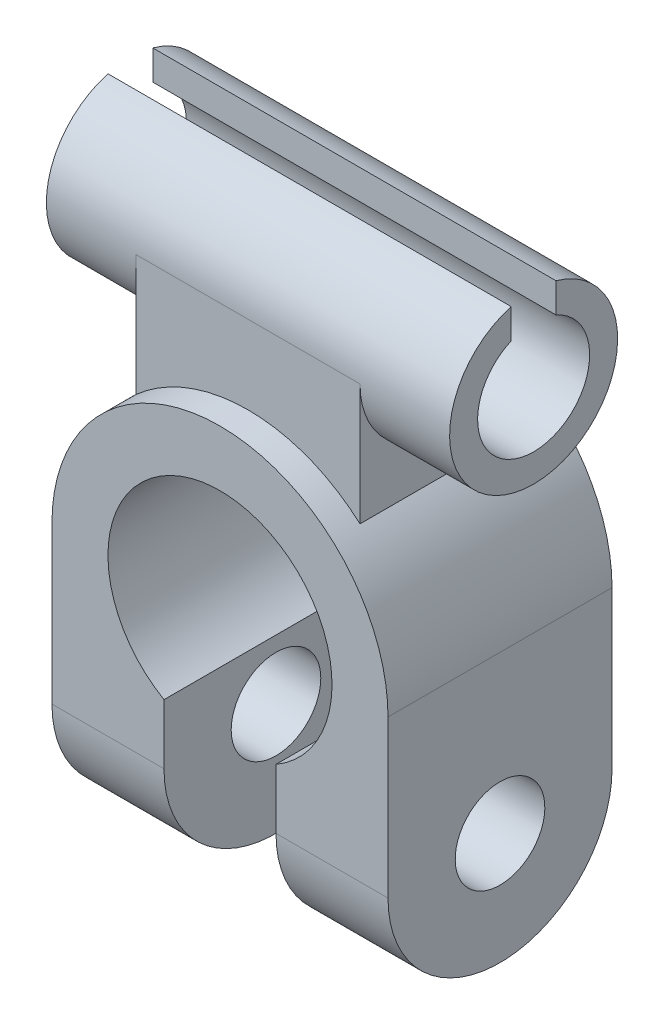
ISO-10303-21;
HEADER;
FILE_DESCRIPTION(('STEP AP214'),'2;1');
FILE_NAME('part.step','',(''),(''),'','','');
FILE_SCHEMA(('AUTOMOTIVE_DESIGN { 1 0 10303 214 1 1 1 1 }'));
ENDSEC;
DATA;
#1=APPLICATION_CONTEXT('core data for automotive mechanical design processes');
#2=APPLICATION_PROTOCOL_DEFINITION('international standard','automotive_design',2000,#1);
#3=PRODUCT_CONTEXT('',#1,'mechanical');
#4=PRODUCT('Part','Part','',(#3));
#5=PRODUCT_RELATED_PRODUCT_CATEGORY('part','',(#4));
#6=PRODUCT_DEFINITION_FORMATION('','',#4);
#7=PRODUCT_DEFINITION_CONTEXT('part definition',#1,'design');
#8=PRODUCT_DEFINITION('design','',#6,#7);
#9=PRODUCT_DEFINITION_SHAPE('','',#8);
#10=(LENGTH_UNIT() NAMED_UNIT(*) SI_UNIT(.MILLI.,.METRE.));
#11=(NAMED_UNIT(*) PLANE_ANGLE_UNIT() SI_UNIT($,.RADIAN.));
#12=(NAMED_UNIT(*) SI_UNIT($,.STERADIAN.) SOLID_ANGLE_UNIT());
#13=UNCERTAINTY_MEASURE_WITH_UNIT(LENGTH_MEASURE(1.E-05),#10,'distance_accuracy_value','');
#14=(GEOMETRIC_REPRESENTATION_CONTEXT(3) GLOBAL_UNCERTAINTY_ASSIGNED_CONTEXT((#13)) GLOBAL_UNIT_ASSIGNED_CONTEXT((#10,
#11,#12)) REPRESENTATION_CONTEXT('',''));
#15=CARTESIAN_POINT('',(0.,0.,0.));
#16=DIRECTION('',(0.,0.,1.));
#17=DIRECTION('',(1.,0.,0.));
#18=AXIS2_PLACEMENT_3D('',#15,#16,#17);
#19=CARTESIAN_POINT('',(0.,0.,-20.));
#20=DIRECTION('',(0.,0.,1.));
#21=DIRECTION('',(1.,0.,0.));
#22=AXIS2_PLACEMENT_3D('',#19,#20,#21);
#23=CYLINDRICAL_SURFACE('',#22,15.);
#24=DIRECTION('',(0.,0.,1.));
#25=VECTOR('',#24,1.);
#26=CARTESIAN_POINT('',(10.,11.1803398874989,-20.));
#27=LINE('',#26,#25);
#28=CARTESIAN_POINT('',(10.,11.1803398874989,-2.49999999999999));
#29=VERTEX_POINT('',#28);
#30=CARTESIAN_POINT('',(10.,11.1803398874989,-17.5));
#31=VERTEX_POINT('',#30);
#32=EDGE_CURVE('E176',#29,#31,#27,.F.);
#33=ORIENTED_EDGE('',*,*,#32,.F.);
#34=CARTESIAN_POINT('',(0.,0.,-2.49999999999999));
#35=DIRECTION('',(0.,0.,-1.));
#36=DIRECTION('',(0.,1.,0.));
#37=AXIS2_PLACEMENT_3D('',#34,#35,#36);
#38=CIRCLE('',#37,15.);
#39=CARTESIAN_POINT('',(-10.,11.1803398874989,-2.49999999999999));
#40=VERTEX_POINT('',#39);
#41=EDGE_CURVE('E179',#29,#40,#38,.F.);
#42=ORIENTED_EDGE('',*,*,#41,.T.);
#43=DIRECTION('',(0.,0.,1.));
#44=VECTOR('',#43,1.);
#45=CARTESIAN_POINT('',(-10.,11.1803398874989,-20.));
#46=LINE('',#45,#44);
#47=CARTESIAN_POINT('',(-10.,11.1803398874989,-17.5));
#48=VERTEX_POINT('',#47);
#49=EDGE_CURVE('E174',#40,#48,#46,.F.);
#50=ORIENTED_EDGE('',*,*,#49,.T.);
#51=CARTESIAN_POINT('',(0.,0.,-17.5));
#52=DIRECTION('',(0.,0.,-1.));
#53=DIRECTION('',(0.,1.,0.));
#54=AXIS2_PLACEMENT_3D('',#51,#52,#53);
#55=CIRCLE('',#54,15.);
#56=EDGE_CURVE('E166',#31,#48,#55,.F.);
#57=ORIENTED_EDGE('',*,*,#56,.F.);
#58=EDGE_LOOP('',(#33,#42,#50,#57));
#59=FACE_BOUND('',#58,.T.);
#60=CARTESIAN_POINT('',(0.,0.,0.));
#61=DIRECTION('',(0.,0.,1.));
#62=DIRECTION('',(1.,0.,0.));
#63=AXIS2_PLACEMENT_3D('',#60,#61,#62);
#64=CIRCLE('',#63,15.);
#65=CARTESIAN_POINT('',(15.,0.,0.));
#66=VERTEX_POINT('',#65);
#67=CARTESIAN_POINT('',(-15.,0.,0.));
#68=VERTEX_POINT('',#67);
#69=EDGE_CURVE('E266',#66,#68,#64,.T.);
#70=ORIENTED_EDGE('',*,*,#69,.F.);
#71=DIRECTION('',(0.,0.,1.));
#72=VECTOR('',#71,1.);
#73=CARTESIAN_POINT('',(15.,0.,-20.));
#74=LINE('',#73,#72);
#75=CARTESIAN_POINT('',(15.,0.,-20.));
#76=VERTEX_POINT('',#75);
#77=EDGE_CURVE('E39',#76,#66,#74,.T.);
#78=ORIENTED_EDGE('',*,*,#77,.F.);
#79=CARTESIAN_POINT('',(0.,0.,-20.));
#80=DIRECTION('',(0.,0.,1.));
#81=DIRECTION('',(1.,0.,0.));
#82=AXIS2_PLACEMENT_3D('',#79,#80,#81);
#83=CIRCLE('',#82,15.);
#84=CARTESIAN_POINT('',(-15.,0.,-20.));
#85=VERTEX_POINT('',#84);
#86=EDGE_CURVE('E243',#76,#85,#83,.T.);
#87=ORIENTED_EDGE('',*,*,#86,.T.);
#88=DIRECTION('',(0.,0.,1.));
#89=VECTOR('',#88,1.);
#90=CARTESIAN_POINT('',(-15.,0.,-20.));
#91=LINE('',#90,#89);
#92=EDGE_CURVE('E283',#85,#68,#91,.T.);
#93=ORIENTED_EDGE('',*,*,#92,.T.);
#94=EDGE_LOOP('',(#70,#78,#87,#93));
#95=FACE_BOUND('',#94,.T.);
#96=ADVANCED_FACE('F35',(#59,#95),#23,.T.);
#97=CARTESIAN_POINT('',(5.,-8.66025403784439,-20.));
#98=DIRECTION('',(-1.,0.,0.));
#99=DIRECTION('',(0.,-1.,0.));
#100=AXIS2_PLACEMENT_3D('',#97,#98,#99);
#101=PLANE('',#100);
#102=CARTESIAN_POINT('',(5.,-14.,-10.));
#103=DIRECTION('',(-1.,0.,0.));
#104=DIRECTION('',(0.,-1.,0.));
#105=AXIS2_PLACEMENT_3D('',#102,#103,#104);
#106=CIRCLE('',#105,4.);
#107=CARTESIAN_POINT('',(5.00000000000001,-18.,-10.));
#108=VERTEX_POINT('',#107);
#109=EDGE_CURVE('E216',#108,#108,#106,.F.);
#110=ORIENTED_EDGE('',*,*,#109,.T.);
#111=EDGE_LOOP('',(#110));
#112=FACE_BOUND('',#111,.T.);
#113=DIRECTION('',(0.,-1.,0.));
#114=VECTOR('',#113,1.);
#115=CARTESIAN_POINT('',(5.,-8.66025403784439,0.));
#116=LINE('',#115,#114);
#117=CARTESIAN_POINT('',(5.,-8.66025403784439,0.));
#118=VERTEX_POINT('',#117);
#119=CARTESIAN_POINT('',(5.,-14.,0.));
#120=VERTEX_POINT('',#119);
#121=EDGE_CURVE('E240',#118,#120,#116,.T.);
#122=ORIENTED_EDGE('',*,*,#121,.F.);
#123=DIRECTION('',(0.,0.,1.));
#124=VECTOR('',#123,1.);
#125=CARTESIAN_POINT('',(5.,-8.66025403784439,-20.));
#126=LINE('',#125,#124);
#127=CARTESIAN_POINT('',(5.,-8.66025403784439,-20.));
#128=VERTEX_POINT('',#127);
#129=EDGE_CURVE('E11',#128,#118,#126,.T.);
#130=ORIENTED_EDGE('',*,*,#129,.F.);
#131=DIRECTION('',(0.,-1.,0.));
#132=VECTOR('',#131,1.);
#133=CARTESIAN_POINT('',(5.,-8.66025403784439,-20.));
#134=LINE('',#133,#132);
#135=CARTESIAN_POINT('',(5.00000000000001,-14.,-20.));
#136=VERTEX_POINT('',#135);
#137=EDGE_CURVE('E258',#128,#136,#134,.T.);
#138=ORIENTED_EDGE('',*,*,#137,.T.);
#139=CARTESIAN_POINT('',(5.,-14.,-10.));
#140=DIRECTION('',(-1.,0.,0.));
#141=DIRECTION('',(0.,-1.,0.));
#142=AXIS2_PLACEMENT_3D('',#139,#140,#141);
#143=CIRCLE('',#142,10.);
#144=EDGE_CURVE('E217',#120,#136,#143,.F.);
#145=ORIENTED_EDGE('',*,*,#144,.F.);
#146=EDGE_LOOP('',(#122,#130,#138,#145));
#147=FACE_BOUND('',#146,.T.);
#148=ADVANCED_FACE('F297',(#112,#147),#101,.T.);
#149=CARTESIAN_POINT('',(0.,0.,-20.));
#150=DIRECTION('',(0.,0.,1.));
#151=DIRECTION('',(1.,0.,0.));
#152=AXIS2_PLACEMENT_3D('',#149,#150,#151);
#153=CYLINDRICAL_SURFACE('',#152,10.);
#154=CARTESIAN_POINT('',(0.,0.,0.));
#155=DIRECTION('',(0.,0.,-1.));
#156=DIRECTION('',(1.,0.,0.));
#157=AXIS2_PLACEMENT_3D('',#154,#155,#156);
#158=CIRCLE('',#157,10.);
#159=CARTESIAN_POINT('',(-5.,-8.66025403784439,0.));
#160=VERTEX_POINT('',#159);
#161=EDGE_CURVE('E278',#160,#118,#158,.T.);
#162=ORIENTED_EDGE('',*,*,#161,.F.);
#163=DIRECTION('',(0.,0.,1.));
#164=VECTOR('',#163,1.);
#165=CARTESIAN_POINT('',(-5.,-8.66025403784439,-20.));
#166=LINE('',#165,#164);
#167=CARTESIAN_POINT('',(-5.,-8.66025403784439,-20.));
#168=VERTEX_POINT('',#167);
#169=EDGE_CURVE('E44',#168,#160,#166,.T.);
#170=ORIENTED_EDGE('',*,*,#169,.F.);
#171=CARTESIAN_POINT('',(0.,0.,-20.));
#172=DIRECTION('',(0.,0.,-1.));
#173=DIRECTION('',(1.,0.,0.));
#174=AXIS2_PLACEMENT_3D('',#171,#172,#173);
#175=CIRCLE('',#174,10.);
#176=EDGE_CURVE('E255',#168,#128,#175,.T.);
#177=ORIENTED_EDGE('',*,*,#176,.T.);
#178=ORIENTED_EDGE('',*,*,#129,.T.);
#179=EDGE_LOOP('',(#162,#170,#177,#178));
#180=FACE_BOUND('',#179,.T.);
#181=ADVANCED_FACE('F314',(#180),#153,.F.);
#182=CARTESIAN_POINT('',(-4.99999999999999,-14.,-20.));
#183=DIRECTION('',(1.,0.,0.));
#184=DIRECTION('',(0.,1.,0.));
#185=AXIS2_PLACEMENT_3D('',#182,#183,#184);
#186=PLANE('',#185);
#187=CARTESIAN_POINT('',(-4.99999999999999,-14.,-10.));
#188=DIRECTION('',(1.,0.,0.));
#189=DIRECTION('',(0.,1.,0.));
#190=AXIS2_PLACEMENT_3D('',#187,#188,#189);
#191=CIRCLE('',#190,4.);
#192=CARTESIAN_POINT('',(-4.99999999999999,-10.,-10.));
#193=VERTEX_POINT('',#192);
#194=EDGE_CURVE('E228',#193,#193,#191,.F.);
#195=ORIENTED_EDGE('',*,*,#194,.T.);
#196=EDGE_LOOP('',(#195));
#197=FACE_BOUND('',#196,.T.);
#198=DIRECTION('',(0.,1.,0.));
#199=VECTOR('',#198,1.);
#200=CARTESIAN_POINT('',(-4.99999999999999,-14.,0.));
#201=LINE('',#200,#199);
#202=CARTESIAN_POINT('',(-4.99999999999999,-14.,0.));
#203=VERTEX_POINT('',#202);
#204=EDGE_CURVE('E275',#203,#160,#201,.T.);
#205=ORIENTED_EDGE('',*,*,#204,.F.);
#206=CARTESIAN_POINT('',(-4.99999999999999,-14.,-10.));
#207=DIRECTION('',(1.,0.,0.));
#208=DIRECTION('',(0.,1.,0.));
#209=AXIS2_PLACEMENT_3D('',#206,#207,#208);
#210=CIRCLE('',#209,10.);
#211=CARTESIAN_POINT('',(-4.99999999999999,-14.,-20.));
#212=VERTEX_POINT('',#211);
#213=EDGE_CURVE('E229',#212,#203,#210,.F.);
#214=ORIENTED_EDGE('',*,*,#213,.F.);
#215=DIRECTION('',(0.,1.,0.));
#216=VECTOR('',#215,1.);
#217=CARTESIAN_POINT('',(-4.99999999999999,-14.,-20.));
#218=LINE('',#217,#216);
#219=EDGE_CURVE('E252',#212,#168,#218,.T.);
#220=ORIENTED_EDGE('',*,*,#219,.T.);
#221=ORIENTED_EDGE('',*,*,#169,.T.);
#222=EDGE_LOOP('',(#205,#214,#220,#221));
#223=FACE_BOUND('',#222,.T.);
#224=ADVANCED_FACE('F312',(#197,#223),#186,.T.);
#225=CARTESIAN_POINT('',(-15.,0.,-20.));
#226=DIRECTION('',(-1.,0.,0.));
#227=DIRECTION('',(0.,-1.,0.));
#228=AXIS2_PLACEMENT_3D('',#225,#226,#227);
#229=PLANE('',#228);
#230=CARTESIAN_POINT('',(-15.,-14.,-10.));
#231=DIRECTION('',(-1.,0.,0.));
#232=DIRECTION('',(0.,-1.,0.));
#233=AXIS2_PLACEMENT_3D('',#230,#231,#232);
#234=CIRCLE('',#233,4.);
#235=CARTESIAN_POINT('',(-15.,-18.,-10.));
#236=VERTEX_POINT('',#235);
#237=EDGE_CURVE('E224',#236,#236,#234,.T.);
#238=ORIENTED_EDGE('',*,*,#237,.F.);
#239=EDGE_LOOP('',(#238));
#240=FACE_BOUND('',#239,.T.);
#241=CARTESIAN_POINT('',(-15.,-14.,-10.));
#242=DIRECTION('',(-1.,0.,0.));
#243=DIRECTION('',(0.,-1.,0.));
#244=AXIS2_PLACEMENT_3D('',#241,#242,#243);
#245=CIRCLE('',#244,10.);
#246=CARTESIAN_POINT('',(-15.,-14.,-20.));
#247=VERTEX_POINT('',#246);
#248=CARTESIAN_POINT('',(-15.,-14.,0.));
#249=VERTEX_POINT('',#248);
#250=EDGE_CURVE('E225',#247,#249,#245,.T.);
#251=ORIENTED_EDGE('',*,*,#250,.T.);
#252=DIRECTION('',(0.,-1.,0.));
#253=VECTOR('',#252,1.);
#254=CARTESIAN_POINT('',(-15.,0.,0.));
#255=LINE('',#254,#253);
#256=EDGE_CURVE('E269',#68,#249,#255,.T.);
#257=ORIENTED_EDGE('',*,*,#256,.F.);
#258=ORIENTED_EDGE('',*,*,#92,.F.);
#259=DIRECTION('',(0.,-1.,0.));
#260=VECTOR('',#259,1.);
#261=CARTESIAN_POINT('',(-15.,0.,-20.));
#262=LINE('',#261,#260);
#263=EDGE_CURVE('E246',#85,#247,#262,.T.);
#264=ORIENTED_EDGE('',*,*,#263,.T.);
#265=EDGE_LOOP('',(#251,#257,#258,#264));
#266=FACE_BOUND('',#265,.T.);
#267=ADVANCED_FACE('F305',(#240,#266),#229,.T.);
#268=CARTESIAN_POINT('',(15.,0.,-20.));
#269=DIRECTION('',(1.,0.,0.));
#270=DIRECTION('',(0.,1.,0.));
#271=AXIS2_PLACEMENT_3D('',#268,#269,#270);
#272=PLANE('',#271);
#273=CARTESIAN_POINT('',(15.,-14.,-10.));
#274=DIRECTION('',(1.,0.,0.));
#275=DIRECTION('',(0.,1.,0.));
#276=AXIS2_PLACEMENT_3D('',#273,#274,#275);
#277=CIRCLE('',#276,4.);
#278=CARTESIAN_POINT('',(15.,-9.99999999999999,-10.));
#279=VERTEX_POINT('',#278);
#280=EDGE_CURVE('E212',#279,#279,#277,.T.);
#281=ORIENTED_EDGE('',*,*,#280,.F.);
#282=EDGE_LOOP('',(#281));
#283=FACE_BOUND('',#282,.T.);
#284=DIRECTION('',(0.,1.,0.));
#285=VECTOR('',#284,1.);
#286=CARTESIAN_POINT('',(15.,0.,0.));
#287=LINE('',#286,#285);
#288=CARTESIAN_POINT('',(15.,-14.,0.));
#289=VERTEX_POINT('',#288);
#290=EDGE_CURVE('E263',#289,#66,#287,.T.);
#291=ORIENTED_EDGE('',*,*,#290,.F.);
#292=CARTESIAN_POINT('',(15.,-14.,-10.));
#293=DIRECTION('',(1.,0.,0.));
#294=DIRECTION('',(0.,1.,0.));
#295=AXIS2_PLACEMENT_3D('',#292,#293,#294);
#296=CIRCLE('',#295,10.);
#297=CARTESIAN_POINT('',(15.,-14.,-20.));
#298=VERTEX_POINT('',#297);
#299=EDGE_CURVE('E213',#289,#298,#296,.T.);
#300=ORIENTED_EDGE('',*,*,#299,.T.);
#301=DIRECTION('',(0.,1.,0.));
#302=VECTOR('',#301,1.);
#303=CARTESIAN_POINT('',(15.,0.,-20.));
#304=LINE('',#303,#302);
#305=EDGE_CURVE('E239',#298,#76,#304,.T.);
#306=ORIENTED_EDGE('',*,*,#305,.T.);
#307=ORIENTED_EDGE('',*,*,#77,.T.);
#308=EDGE_LOOP('',(#291,#300,#306,#307));
#309=FACE_BOUND('',#308,.T.);
#310=ADVANCED_FACE('F37',(#283,#309),#272,.T.);
#311=CARTESIAN_POINT('',(0.,0.,-20.));
#312=DIRECTION('',(0.,0.,1.));
#313=DIRECTION('',(1.,0.,0.));
#314=AXIS2_PLACEMENT_3D('',#311,#312,#313);
#315=PLANE('',#314);
#316=DIRECTION('',(1.,0.,0.));
#317=VECTOR('',#316,1.);
#318=CARTESIAN_POINT('',(5.00000000000001,-14.,-20.));
#319=LINE('',#318,#317);
#320=EDGE_CURVE('E236',#136,#298,#319,.T.);
#321=ORIENTED_EDGE('',*,*,#320,.F.);
#322=ORIENTED_EDGE('',*,*,#137,.F.);
#323=ORIENTED_EDGE('',*,*,#176,.F.);
#324=ORIENTED_EDGE('',*,*,#219,.F.);
#325=DIRECTION('',(1.,0.,0.));
#326=VECTOR('',#325,1.);
#327=CARTESIAN_POINT('',(-15.,-14.,-20.));
#328=LINE('',#327,#326);
#329=EDGE_CURVE('E249',#247,#212,#328,.T.);
#330=ORIENTED_EDGE('',*,*,#329,.F.);
#331=ORIENTED_EDGE('',*,*,#263,.F.);
#332=ORIENTED_EDGE('',*,*,#86,.F.);
#333=ORIENTED_EDGE('',*,*,#305,.F.);
#334=EDGE_LOOP('',(#321,#322,#323,#324,#330,#331,#332,#333));
#335=FACE_BOUND('',#334,.T.);
#336=ADVANCED_FACE('F301',(#335),#315,.F.);
#337=CARTESIAN_POINT('',(0.,0.,0.));
#338=DIRECTION('',(0.,0.,1.));
#339=DIRECTION('',(1.,0.,0.));
#340=AXIS2_PLACEMENT_3D('',#337,#338,#339);
#341=PLANE('',#340);
#342=DIRECTION('',(1.,0.,0.));
#343=VECTOR('',#342,1.);
#344=CARTESIAN_POINT('',(5.00000000000001,-14.,0.));
#345=LINE('',#344,#343);
#346=EDGE_CURVE('E235',#120,#289,#345,.T.);
#347=ORIENTED_EDGE('',*,*,#346,.T.);
#348=ORIENTED_EDGE('',*,*,#290,.T.);
#349=ORIENTED_EDGE('',*,*,#69,.T.);
#350=ORIENTED_EDGE('',*,*,#256,.T.);
#351=DIRECTION('',(1.,0.,0.));
#352=VECTOR('',#351,1.);
#353=CARTESIAN_POINT('',(-15.,-14.,0.));
#354=LINE('',#353,#352);
#355=EDGE_CURVE('E272',#249,#203,#354,.T.);
#356=ORIENTED_EDGE('',*,*,#355,.T.);
#357=ORIENTED_EDGE('',*,*,#204,.T.);
#358=ORIENTED_EDGE('',*,*,#161,.T.);
#359=ORIENTED_EDGE('',*,*,#121,.T.);
#360=EDGE_LOOP('',(#347,#348,#349,#350,#356,#357,#358,#359));
#361=FACE_BOUND('',#360,.T.);
#362=ADVANCED_FACE('F291',(#361),#341,.T.);
#363=CARTESIAN_POINT('',(17.3606797749979,-14.,-10.));
#364=DIRECTION('',(-1.,0.,0.));
#365=DIRECTION('',(0.,-1.,0.));
#366=AXIS2_PLACEMENT_3D('',#363,#364,#365);
#367=CYLINDRICAL_SURFACE('',#366,4.);
#368=ORIENTED_EDGE('',*,*,#237,.T.);
#369=EDGE_LOOP('',(#368));
#370=FACE_BOUND('',#369,.T.);
#371=ORIENTED_EDGE('',*,*,#194,.F.);
#372=EDGE_LOOP('',(#371));
#373=FACE_BOUND('',#372,.T.);
#374=ADVANCED_FACE('F339',(#370,#373),#367,.F.);
#375=CARTESIAN_POINT('',(17.3606797749979,-14.,-10.));
#376=DIRECTION('',(-1.,0.,0.));
#377=DIRECTION('',(0.,-1.,0.));
#378=AXIS2_PLACEMENT_3D('',#375,#376,#377);
#379=CYLINDRICAL_SURFACE('',#378,10.);
#380=ORIENTED_EDGE('',*,*,#329,.T.);
#381=ORIENTED_EDGE('',*,*,#213,.T.);
#382=ORIENTED_EDGE('',*,*,#355,.F.);
#383=ORIENTED_EDGE('',*,*,#250,.F.);
#384=EDGE_LOOP('',(#380,#381,#382,#383));
#385=FACE_BOUND('',#384,.T.);
#386=ADVANCED_FACE('F307',(#385),#379,.T.);
#387=CARTESIAN_POINT('',(-17.3606797749979,-14.,-10.));
#388=DIRECTION('',(1.,0.,0.));
#389=DIRECTION('',(0.,1.,0.));
#390=AXIS2_PLACEMENT_3D('',#387,#388,#389);
#391=CYLINDRICAL_SURFACE('',#390,4.);
#392=ORIENTED_EDGE('',*,*,#280,.T.);
#393=EDGE_LOOP('',(#392));
#394=FACE_BOUND('',#393,.T.);
#395=ORIENTED_EDGE('',*,*,#109,.F.);
#396=EDGE_LOOP('',(#395));
#397=FACE_BOUND('',#396,.T.);
#398=ADVANCED_FACE('F348',(#394,#397),#391,.F.);
#399=CARTESIAN_POINT('',(-17.3606797749979,-14.,-10.));
#400=DIRECTION('',(1.,0.,0.));
#401=DIRECTION('',(0.,1.,0.));
#402=AXIS2_PLACEMENT_3D('',#399,#400,#401);
#403=CYLINDRICAL_SURFACE('',#402,10.);
#404=ORIENTED_EDGE('',*,*,#346,.F.);
#405=ORIENTED_EDGE('',*,*,#144,.T.);
#406=ORIENTED_EDGE('',*,*,#320,.T.);
#407=ORIENTED_EDGE('',*,*,#299,.F.);
#408=EDGE_LOOP('',(#404,#405,#406,#407));
#409=FACE_BOUND('',#408,.T.);
#410=ADVANCED_FACE('F295',(#409),#403,.T.);
#411=CARTESIAN_POINT('',(10.,0.,-2.49999999999999));
#412=DIRECTION('',(0.,0.,-1.));
#413=DIRECTION('',(0.,1.,0.));
#414=AXIS2_PLACEMENT_3D('',#411,#412,#413);
#415=PLANE('',#414);
#416=ORIENTED_EDGE('',*,*,#41,.F.);
#417=DIRECTION('',(0.,-1.,0.));
#418=VECTOR('',#417,1.);
#419=CARTESIAN_POINT('',(10.,0.,-2.49999999999999));
#420=LINE('',#419,#418);
#421=CARTESIAN_POINT('',(10.,22.,-2.5));
#422=VERTEX_POINT('',#421);
#423=EDGE_CURVE('E169',#422,#29,#420,.T.);
#424=ORIENTED_EDGE('',*,*,#423,.F.);
#425=DIRECTION('',(-1.,0.,0.));
#426=VECTOR('',#425,1.);
#427=CARTESIAN_POINT('',(10.,22.,-2.5));
#428=LINE('',#427,#426);
#429=CARTESIAN_POINT('',(-10.,22.,-2.5));
#430=VERTEX_POINT('',#429);
#431=EDGE_CURVE('E60',#422,#430,#428,.T.);
#432=ORIENTED_EDGE('',*,*,#431,.T.);
#433=DIRECTION('',(0.,-1.,0.));
#434=VECTOR('',#433,1.);
#435=CARTESIAN_POINT('',(-10.,0.,-2.49999999999999));
#436=LINE('',#435,#434);
#437=EDGE_CURVE('E162',#430,#40,#436,.T.);
#438=ORIENTED_EDGE('',*,*,#437,.T.);
#439=EDGE_LOOP('',(#416,#424,#432,#438));
#440=FACE_BOUND('',#439,.T.);
#441=ADVANCED_FACE('F372',(#440),#415,.F.);
#442=CARTESIAN_POINT('',(10.,0.,-17.5));
#443=DIRECTION('',(0.,0.,-1.));
#444=DIRECTION('',(0.,1.,0.));
#445=AXIS2_PLACEMENT_3D('',#442,#443,#444);
#446=PLANE('',#445);
#447=DIRECTION('',(0.,-1.,0.));
#448=VECTOR('',#447,1.);
#449=CARTESIAN_POINT('',(10.,0.,-17.5));
#450=LINE('',#449,#448);
#451=CARTESIAN_POINT('',(10.,22.,-17.5));
#452=VERTEX_POINT('',#451);
#453=EDGE_CURVE('E157',#452,#31,#450,.T.);
#454=ORIENTED_EDGE('',*,*,#453,.T.);
#455=ORIENTED_EDGE('',*,*,#56,.T.);
#456=DIRECTION('',(0.,-1.,0.));
#457=VECTOR('',#456,1.);
#458=CARTESIAN_POINT('',(-10.,0.,-17.5));
#459=LINE('',#458,#457);
#460=CARTESIAN_POINT('',(-10.,22.,-17.5));
#461=VERTEX_POINT('',#460);
#462=EDGE_CURVE('E52',#461,#48,#459,.T.);
#463=ORIENTED_EDGE('',*,*,#462,.F.);
#464=DIRECTION('',(-1.,0.,0.));
#465=VECTOR('',#464,1.);
#466=CARTESIAN_POINT('',(10.,22.,-17.5));
#467=LINE('',#466,#465);
#468=EDGE_CURVE('E148',#452,#461,#467,.T.);
#469=ORIENTED_EDGE('',*,*,#468,.F.);
#470=EDGE_LOOP('',(#454,#455,#463,#469));
#471=FACE_BOUND('',#470,.T.);
#472=ADVANCED_FACE('F164',(#471),#446,.T.);
#473=CARTESIAN_POINT('',(10.,0.,0.));
#474=DIRECTION('',(1.,0.,0.));
#475=DIRECTION('',(0.,0.,-1.));
#476=AXIS2_PLACEMENT_3D('',#473,#474,#475);
#477=PLANE('',#476);
#478=ORIENTED_EDGE('',*,*,#423,.T.);
#479=ORIENTED_EDGE('',*,*,#32,.T.);
#480=ORIENTED_EDGE('',*,*,#453,.F.);
#481=CARTESIAN_POINT('',(10.,22.,-9.99999999999999));
#482=DIRECTION('',(1.,0.,0.));
#483=DIRECTION('',(0.,0.,-1.));
#484=AXIS2_PLACEMENT_3D('',#481,#482,#483);
#485=CIRCLE('',#484,7.5);
#486=EDGE_CURVE('E153',#422,#452,#485,.T.);
#487=ORIENTED_EDGE('',*,*,#486,.F.);
#488=EDGE_LOOP('',(#478,#479,#480,#487));
#489=FACE_BOUND('',#488,.T.);
#490=ADVANCED_FACE('F469',(#489),#477,.T.);
#491=CARTESIAN_POINT('',(-10.,0.,0.));
#492=DIRECTION('',(1.,0.,0.));
#493=DIRECTION('',(0.,0.,-1.));
#494=AXIS2_PLACEMENT_3D('',#491,#492,#493);
#495=PLANE('',#494);
#496=ORIENTED_EDGE('',*,*,#49,.F.);
#497=ORIENTED_EDGE('',*,*,#437,.F.);
#498=CARTESIAN_POINT('',(-10.,22.,-9.99999999999999));
#499=DIRECTION('',(1.,0.,0.));
#500=DIRECTION('',(0.,0.,-1.));
#501=AXIS2_PLACEMENT_3D('',#498,#499,#500);
#502=CIRCLE('',#501,7.5);
#503=EDGE_CURVE('E151',#430,#461,#502,.T.);
#504=ORIENTED_EDGE('',*,*,#503,.T.);
#505=ORIENTED_EDGE('',*,*,#462,.T.);
#506=EDGE_LOOP('',(#496,#497,#504,#505));
#507=FACE_BOUND('',#506,.T.);
#508=ADVANCED_FACE('F160',(#507),#495,.F.);
#509=CARTESIAN_POINT('',(18.,22.,-9.99999999999999));
#510=DIRECTION('',(-1.,0.,0.));
#511=DIRECTION('',(0.,0.,1.));
#512=AXIS2_PLACEMENT_3D('',#509,#510,#511);
#513=CYLINDRICAL_SURFACE('',#512,5.);
#514=CARTESIAN_POINT('',(-18.,22.,-9.99999999999999));
#515=DIRECTION('',(1.,0.,0.));
#516=DIRECTION('',(0.,0.,-1.));
#517=AXIS2_PLACEMENT_3D('',#514,#515,#516);
#518=CIRCLE('',#517,5.);
#519=CARTESIAN_POINT('',(-18.,26.5825756949558,-7.99999999999999));
#520=VERTEX_POINT('',#519);
#521=CARTESIAN_POINT('',(-18.,26.5825756949558,-12.));
#522=VERTEX_POINT('',#521);
#523=EDGE_CURVE('E182',#520,#522,#518,.T.);
#524=ORIENTED_EDGE('',*,*,#523,.F.);
#525=DIRECTION('',(-1.,0.,0.));
#526=VECTOR('',#525,1.);
#527=CARTESIAN_POINT('',(18.,26.5825756949558,-7.99999999999999));
#528=LINE('',#527,#526);
#529=CARTESIAN_POINT('',(18.,26.5825756949558,-7.99999999999999));
#530=VERTEX_POINT('',#529);
#531=EDGE_CURVE('E210',#530,#520,#528,.T.);
#532=ORIENTED_EDGE('',*,*,#531,.F.);
#533=CARTESIAN_POINT('',(18.,22.,-9.99999999999999));
#534=DIRECTION('',(1.,0.,0.));
#535=DIRECTION('',(0.,0.,-1.));
#536=AXIS2_PLACEMENT_3D('',#533,#534,#535);
#537=CIRCLE('',#536,5.);
#538=CARTESIAN_POINT('',(18.,26.5825756949558,-12.));
#539=VERTEX_POINT('',#538);
#540=EDGE_CURVE('E183',#530,#539,#537,.T.);
#541=ORIENTED_EDGE('',*,*,#540,.T.);
#542=DIRECTION('',(-1.,0.,0.));
#543=VECTOR('',#542,1.);
#544=CARTESIAN_POINT('',(18.,26.5825756949558,-12.));
#545=LINE('',#544,#543);
#546=EDGE_CURVE('E194',#539,#522,#545,.T.);
#547=ORIENTED_EDGE('',*,*,#546,.T.);
#548=EDGE_LOOP('',(#524,#532,#541,#547));
#549=FACE_BOUND('',#548,.T.);
#550=ADVANCED_FACE('F401',(#549),#513,.F.);
#551=CARTESIAN_POINT('',(18.,0.,-7.99999999999999));
#552=DIRECTION('',(0.,0.,-1.));
#553=DIRECTION('',(-1.,0.,0.));
#554=AXIS2_PLACEMENT_3D('',#551,#552,#553);
#555=PLANE('',#554);
#556=DIRECTION('',(0.,-1.,0.));
#557=VECTOR('',#556,1.);
#558=CARTESIAN_POINT('',(-18.,0.,-7.99999999999999));
#559=LINE('',#558,#557);
#560=CARTESIAN_POINT('',(-18.,29.2284161474005,-7.99999999999999));
#561=VERTEX_POINT('',#560);
#562=EDGE_CURVE('E197',#561,#520,#559,.T.);
#563=ORIENTED_EDGE('',*,*,#562,.F.);
#564=DIRECTION('',(-1.,0.,0.));
#565=VECTOR('',#564,1.);
#566=CARTESIAN_POINT('',(18.,29.2284161474005,-7.99999999999999));
#567=LINE('',#566,#565);
#568=CARTESIAN_POINT('',(18.,29.2284161474005,-7.99999999999999));
#569=VERTEX_POINT('',#568);
#570=EDGE_CURVE('E208',#569,#561,#567,.T.);
#571=ORIENTED_EDGE('',*,*,#570,.F.);
#572=DIRECTION('',(0.,-1.,0.));
#573=VECTOR('',#572,1.);
#574=CARTESIAN_POINT('',(18.,0.,-7.99999999999999));
#575=LINE('',#574,#573);
#576=EDGE_CURVE('E186',#569,#530,#575,.T.);
#577=ORIENTED_EDGE('',*,*,#576,.T.);
#578=ORIENTED_EDGE('',*,*,#531,.T.);
#579=EDGE_LOOP('',(#563,#571,#577,#578));
#580=FACE_BOUND('',#579,.T.);
#581=ADVANCED_FACE('F406',(#580),#555,.T.);
#582=CARTESIAN_POINT('',(18.,0.,0.));
#583=DIRECTION('',(1.,0.,0.));
#584=DIRECTION('',(0.,0.,-1.));
#585=AXIS2_PLACEMENT_3D('',#582,#583,#584);
#586=PLANE('',#585);
#587=ORIENTED_EDGE('',*,*,#540,.F.);
#588=ORIENTED_EDGE('',*,*,#576,.F.);
#589=CARTESIAN_POINT('',(18.,22.,-9.99999999999999));
#590=DIRECTION('',(1.,0.,0.));
#591=DIRECTION('',(0.,0.,-1.));
#592=AXIS2_PLACEMENT_3D('',#589,#590,#591);
#593=CIRCLE('',#592,7.5);
#594=CARTESIAN_POINT('',(18.,29.2284161474005,-12.));
#595=VERTEX_POINT('',#594);
#596=EDGE_CURVE('E190',#569,#595,#593,.T.);
#597=ORIENTED_EDGE('',*,*,#596,.T.);
#598=DIRECTION('',(0.,-1.,0.));
#599=VECTOR('',#598,1.);
#600=CARTESIAN_POINT('',(18.,0.,-12.));
#601=LINE('',#600,#599);
#602=EDGE_CURVE('E192',#595,#539,#601,.T.);
#603=ORIENTED_EDGE('',*,*,#602,.T.);
#604=EDGE_LOOP('',(#587,#588,#597,#603));
#605=FACE_BOUND('',#604,.T.);
#606=ADVANCED_FACE('F417',(#605),#586,.T.);
#607=CARTESIAN_POINT('',(18.,0.,-12.));
#608=DIRECTION('',(0.,0.,-1.));
#609=DIRECTION('',(-1.,0.,0.));
#610=AXIS2_PLACEMENT_3D('',#607,#608,#609);
#611=PLANE('',#610);
#612=DIRECTION('',(0.,-1.,0.));
#613=VECTOR('',#612,1.);
#614=CARTESIAN_POINT('',(-18.,0.,-12.));
#615=LINE('',#614,#613);
#616=CARTESIAN_POINT('',(-18.,29.2284161474005,-12.));
#617=VERTEX_POINT('',#616);
#618=EDGE_CURVE('E187',#617,#522,#615,.T.);
#619=ORIENTED_EDGE('',*,*,#618,.T.);
#620=ORIENTED_EDGE('',*,*,#546,.F.);
#621=ORIENTED_EDGE('',*,*,#602,.F.);
#622=DIRECTION('',(-1.,0.,0.));
#623=VECTOR('',#622,1.);
#624=CARTESIAN_POINT('',(18.,29.2284161474005,-12.));
#625=LINE('',#624,#623);
#626=EDGE_CURVE('E205',#595,#617,#625,.T.);
#627=ORIENTED_EDGE('',*,*,#626,.T.);
#628=EDGE_LOOP('',(#619,#620,#621,#627));
#629=FACE_BOUND('',#628,.T.);
#630=ADVANCED_FACE('F425',(#629),#611,.F.);
#631=CARTESIAN_POINT('',(-18.,0.,0.));
#632=DIRECTION('',(1.,0.,0.));
#633=DIRECTION('',(0.,0.,-1.));
#634=AXIS2_PLACEMENT_3D('',#631,#632,#633);
#635=PLANE('',#634);
#636=ORIENTED_EDGE('',*,*,#523,.T.);
#637=ORIENTED_EDGE('',*,*,#618,.F.);
#638=CARTESIAN_POINT('',(-18.,22.,-9.99999999999999));
#639=DIRECTION('',(1.,0.,0.));
#640=DIRECTION('',(0.,0.,-1.));
#641=AXIS2_PLACEMENT_3D('',#638,#639,#640);
#642=CIRCLE('',#641,7.5);
#643=EDGE_CURVE('E200',#561,#617,#642,.T.);
#644=ORIENTED_EDGE('',*,*,#643,.F.);
#645=ORIENTED_EDGE('',*,*,#562,.T.);
#646=EDGE_LOOP('',(#636,#637,#644,#645));
#647=FACE_BOUND('',#646,.T.);
#648=ADVANCED_FACE('F430',(#647),#635,.F.);
#649=CARTESIAN_POINT('',(18.,22.,-9.99999999999999));
#650=DIRECTION('',(-1.,0.,0.));
#651=DIRECTION('',(0.,0.,1.));
#652=AXIS2_PLACEMENT_3D('',#649,#650,#651);
#653=CYLINDRICAL_SURFACE('',#652,7.5);
#654=ORIENTED_EDGE('',*,*,#431,.F.);
#655=ORIENTED_EDGE('',*,*,#486,.T.);
#656=ORIENTED_EDGE('',*,*,#468,.T.);
#657=ORIENTED_EDGE('',*,*,#503,.F.);
#658=EDGE_LOOP('',(#654,#655,#656,#657));
#659=FACE_BOUND('',#658,.T.);
#660=ORIENTED_EDGE('',*,*,#643,.T.);
#661=ORIENTED_EDGE('',*,*,#626,.F.);
#662=ORIENTED_EDGE('',*,*,#596,.F.);
#663=ORIENTED_EDGE('',*,*,#570,.T.);
#664=EDGE_LOOP('',(#660,#661,#662,#663));
#665=FACE_BOUND('',#664,.T.);
#666=ADVANCED_FACE('F149',(#659,#665),#653,.T.);
#667=CLOSED_SHELL('',(#96,#148,#181,#224,#267,#310,#336,#362,#374,#386,#398,#410,#441,#472,#490,
#508,#550,#581,#606,#630,#648,#666));
#668=MANIFOLD_SOLID_BREP('B2',#667);
#669=ADVANCED_BREP_SHAPE_REPRESENTATION('',(#18,#668),#14);
#670=SHAPE_DEFINITION_REPRESENTATION(#9,#669);
ENDSEC;
END-ISO-10303-21;
